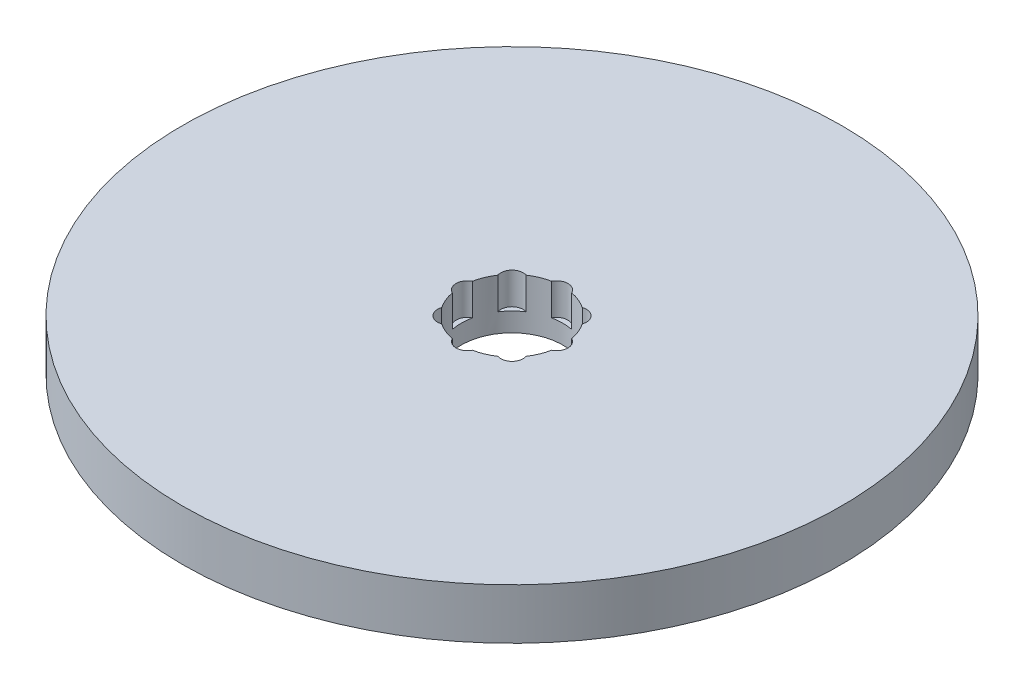
ISO-10303-21;
HEADER;
FILE_DESCRIPTION(('STEP AP214'),'2;1');
FILE_NAME('part.step','',(''),(''),'','','');
FILE_SCHEMA(('AUTOMOTIVE_DESIGN { 1 0 10303 214 1 1 1 1 }'));
ENDSEC;
DATA;
#1=APPLICATION_CONTEXT('core data for automotive mechanical design processes');
#2=APPLICATION_PROTOCOL_DEFINITION('international standard','automotive_design',2000,#1);
#3=PRODUCT_CONTEXT('',#1,'mechanical');
#4=PRODUCT('Part','Part','',(#3));
#5=PRODUCT_RELATED_PRODUCT_CATEGORY('part','',(#4));
#6=PRODUCT_DEFINITION_FORMATION('','',#4);
#7=PRODUCT_DEFINITION_CONTEXT('part definition',#1,'design');
#8=PRODUCT_DEFINITION('design','',#6,#7);
#9=PRODUCT_DEFINITION_SHAPE('','',#8);
#10=(LENGTH_UNIT() NAMED_UNIT(*) SI_UNIT(.MILLI.,.METRE.));
#11=(NAMED_UNIT(*) PLANE_ANGLE_UNIT() SI_UNIT($,.RADIAN.));
#12=(NAMED_UNIT(*) SI_UNIT($,.STERADIAN.) SOLID_ANGLE_UNIT());
#13=UNCERTAINTY_MEASURE_WITH_UNIT(LENGTH_MEASURE(1.E-05),#10,'distance_accuracy_value','');
#14=(GEOMETRIC_REPRESENTATION_CONTEXT(3) GLOBAL_UNCERTAINTY_ASSIGNED_CONTEXT((#13)) GLOBAL_UNIT_ASSIGNED_CONTEXT((#10,
#11,#12)) REPRESENTATION_CONTEXT('',''));
#15=CARTESIAN_POINT('',(0.,0.,0.));
#16=DIRECTION('',(0.,0.,1.));
#17=DIRECTION('',(1.,0.,0.));
#18=AXIS2_PLACEMENT_3D('',#15,#16,#17);
#19=CARTESIAN_POINT('',(0.,10.,0.));
#20=DIRECTION('',(0.,-1.,0.));
#21=DIRECTION('',(0.,0.,-1.));
#22=AXIS2_PLACEMENT_3D('',#19,#20,#21);
#23=CYLINDRICAL_SURFACE('',#22,65.);
#24=CARTESIAN_POINT('',(0.,10.,0.));
#25=DIRECTION('',(0.,1.,0.));
#26=DIRECTION('',(0.,0.,1.));
#27=AXIS2_PLACEMENT_3D('',#24,#25,#26);
#28=CIRCLE('',#27,65.);
#29=CARTESIAN_POINT('',(0.,10.,65.));
#30=VERTEX_POINT('',#29);
#31=EDGE_CURVE('E183',#30,#30,#28,.T.);
#32=ORIENTED_EDGE('',*,*,#31,.F.);
#33=EDGE_LOOP('',(#32));
#34=FACE_BOUND('',#33,.T.);
#35=CARTESIAN_POINT('',(0.,0.,0.));
#36=DIRECTION('',(0.,1.,0.));
#37=DIRECTION('',(0.,0.,1.));
#38=AXIS2_PLACEMENT_3D('',#35,#36,#37);
#39=CIRCLE('',#38,65.);
#40=CARTESIAN_POINT('',(0.,0.,65.));
#41=VERTEX_POINT('',#40);
#42=EDGE_CURVE('E182',#41,#41,#39,.T.);
#43=ORIENTED_EDGE('',*,*,#42,.T.);
#44=EDGE_LOOP('',(#43));
#45=FACE_BOUND('',#44,.T.);
#46=ADVANCED_FACE('F39',(#34,#45),#23,.T.);
#47=CARTESIAN_POINT('',(0.,10.,0.));
#48=DIRECTION('',(0.,1.,0.));
#49=DIRECTION('',(0.,0.,1.));
#50=AXIS2_PLACEMENT_3D('',#47,#48,#49);
#51=PLANE('',#50);
#52=CARTESIAN_POINT('',(0.,10.,8.81832468937338));
#53=DIRECTION('',(0.,1.,0.));
#54=DIRECTION('',(1.,0.,0.));
#55=AXIS2_PLACEMENT_3D('',#52,#53,#54);
#56=CIRCLE('',#55,2.20818495397574);
#57=CARTESIAN_POINT('',(-1.97663540559825,10.,9.80269924425591));
#58=VERTEX_POINT('',#57);
#59=CARTESIAN_POINT('',(1.97663540559832,10.,9.8026992442559));
#60=VERTEX_POINT('',#59);
#61=EDGE_CURVE('E256',#58,#60,#56,.T.);
#62=ORIENTED_EDGE('',*,*,#61,.F.);
#63=CARTESIAN_POINT('',(0.,10.,0.));
#64=DIRECTION('',(0.,1.,0.));
#65=DIRECTION('',(0.,0.,1.));
#66=AXIS2_PLACEMENT_3D('',#63,#64,#65);
#67=CIRCLE('',#66,10.);
#68=CARTESIAN_POINT('',(-5.53386281031361,10.,8.32924740877757));
#69=VERTEX_POINT('',#68);
#70=EDGE_CURVE('E175',#69,#58,#67,.T.);
#71=ORIENTED_EDGE('',*,*,#70,.F.);
#72=CARTESIAN_POINT('',(-6.23549718656067,10.,6.23549718656069));
#73=DIRECTION('',(0.,1.,0.));
#74=DIRECTION('',(0.707106781186549,0.,0.707106781186546));
#75=AXIS2_PLACEMENT_3D('',#72,#73,#74);
#76=CIRCLE('',#75,2.20818495397574);
#77=CARTESIAN_POINT('',(-8.32924740877755,10.,5.53386281031364));
#78=VERTEX_POINT('',#77);
#79=EDGE_CURVE('E152',#78,#69,#76,.T.);
#80=ORIENTED_EDGE('',*,*,#79,.F.);
#81=CARTESIAN_POINT('',(-9.8026992442559,10.,1.97663540559828));
#82=VERTEX_POINT('',#81);
#83=EDGE_CURVE('E168',#82,#78,#67,.T.);
#84=ORIENTED_EDGE('',*,*,#83,.F.);
#85=CARTESIAN_POINT('',(-8.81832468937338,10.,0.));
#86=DIRECTION('',(0.,1.,0.));
#87=DIRECTION('',(0.,0.,1.));
#88=AXIS2_PLACEMENT_3D('',#85,#86,#87);
#89=CIRCLE('',#88,2.20818495397574);
#90=CARTESIAN_POINT('',(-9.8026992442559,10.,-1.97663540559828));
#91=VERTEX_POINT('',#90);
#92=EDGE_CURVE('E205',#91,#82,#89,.T.);
#93=ORIENTED_EDGE('',*,*,#92,.F.);
#94=CARTESIAN_POINT('',(-8.32924740877763,10.,-5.53386281031353));
#95=VERTEX_POINT('',#94);
#96=EDGE_CURVE('E181',#95,#91,#67,.T.);
#97=ORIENTED_EDGE('',*,*,#96,.F.);
#98=CARTESIAN_POINT('',(-6.23549718656075,10.,-6.2354971865606));
#99=DIRECTION('',(0.,1.,0.));
#100=DIRECTION('',(-0.707106781186539,0.,0.707106781186556));
#101=AXIS2_PLACEMENT_3D('',#98,#99,#100);
#102=CIRCLE('',#101,2.20818495397574);
#103=CARTESIAN_POINT('',(-5.53386281031373,10.,-8.3292474087775));
#104=VERTEX_POINT('',#103);
#105=EDGE_CURVE('E453',#104,#95,#102,.T.);
#106=ORIENTED_EDGE('',*,*,#105,.F.);
#107=CARTESIAN_POINT('',(-1.97663540559839,10.,-9.80269924425588));
#108=VERTEX_POINT('',#107);
#109=EDGE_CURVE('E189',#108,#104,#67,.T.);
#110=ORIENTED_EDGE('',*,*,#109,.F.);
#111=CARTESIAN_POINT('',(0.,10.,-8.81832468937338));
#112=DIRECTION('',(0.,1.,0.));
#113=DIRECTION('',(-1.,0.,0.));
#114=AXIS2_PLACEMENT_3D('',#111,#112,#113);
#115=CIRCLE('',#114,2.20818495397574);
#116=CARTESIAN_POINT('',(1.97663540559818,10.,-9.80269924425593));
#117=VERTEX_POINT('',#116);
#118=EDGE_CURVE('E462',#117,#108,#115,.T.);
#119=ORIENTED_EDGE('',*,*,#118,.F.);
#120=CARTESIAN_POINT('',(5.53386281031356,10.,-8.32924740877761));
#121=VERTEX_POINT('',#120);
#122=EDGE_CURVE('E197',#121,#117,#67,.T.);
#123=ORIENTED_EDGE('',*,*,#122,.F.);
#124=CARTESIAN_POINT('',(6.23549718656062,10.,-6.23549718656073));
#125=DIRECTION('',(0.,1.,0.));
#126=DIRECTION('',(-0.707106781186554,0.,-0.707106781186541));
#127=AXIS2_PLACEMENT_3D('',#124,#125,#126);
#128=CIRCLE('',#127,2.20818495397574);
#129=CARTESIAN_POINT('',(8.32924740877752,10.,-5.5338628103137));
#130=VERTEX_POINT('',#129);
#131=EDGE_CURVE('E470',#130,#121,#128,.T.);
#132=ORIENTED_EDGE('',*,*,#131,.F.);
#133=CARTESIAN_POINT('',(9.8026992442559,10.,-1.97663540559828));
#134=VERTEX_POINT('',#133);
#135=EDGE_CURVE('E489',#134,#130,#67,.T.);
#136=ORIENTED_EDGE('',*,*,#135,.F.);
#137=CARTESIAN_POINT('',(8.81832468937338,10.,0.));
#138=DIRECTION('',(0.,1.,0.));
#139=DIRECTION('',(0.,0.,-1.));
#140=AXIS2_PLACEMENT_3D('',#137,#138,#139);
#141=CIRCLE('',#140,2.20818495397574);
#142=CARTESIAN_POINT('',(9.8026992442559,10.,1.97663540559828));
#143=VERTEX_POINT('',#142);
#144=EDGE_CURVE('E476',#143,#134,#141,.T.);
#145=ORIENTED_EDGE('',*,*,#144,.F.);
#146=CARTESIAN_POINT('',(8.32924740877759,10.,5.53386281031358));
#147=VERTEX_POINT('',#146);
#148=EDGE_CURVE('E491',#147,#143,#67,.T.);
#149=ORIENTED_EDGE('',*,*,#148,.F.);
#150=CARTESIAN_POINT('',(6.23549718656071,10.,6.23549718656064));
#151=DIRECTION('',(0.,1.,0.));
#152=DIRECTION('',(0.707106781186544,0.,-0.707106781186551));
#153=AXIS2_PLACEMENT_3D('',#150,#151,#152);
#154=CIRCLE('',#153,2.20818495397574);
#155=CARTESIAN_POINT('',(5.53386281031367,10.,8.32924740877754));
#156=VERTEX_POINT('',#155);
#157=EDGE_CURVE('E475',#156,#147,#154,.T.);
#158=ORIENTED_EDGE('',*,*,#157,.F.);
#159=EDGE_CURVE('E190',#60,#156,#67,.T.);
#160=ORIENTED_EDGE('',*,*,#159,.F.);
#161=EDGE_LOOP('',(#62,#71,#80,#84,#93,#97,#106,#110,#119,#123,#132,#136,#145,#149,#158,#160));
#162=FACE_BOUND('',#161,.T.);
#163=ORIENTED_EDGE('',*,*,#31,.T.);
#164=EDGE_LOOP('',(#163));
#165=FACE_BOUND('',#164,.T.);
#166=ADVANCED_FACE('F170',(#162,#165),#51,.T.);
#167=CARTESIAN_POINT('',(0.,0.,0.));
#168=DIRECTION('',(0.,1.,0.));
#169=DIRECTION('',(0.,0.,1.));
#170=AXIS2_PLACEMENT_3D('',#167,#168,#169);
#171=PLANE('',#170);
#172=CARTESIAN_POINT('',(0.,0.,0.));
#173=DIRECTION('',(0.,1.,0.));
#174=DIRECTION('',(0.,0.,1.));
#175=AXIS2_PLACEMENT_3D('',#172,#173,#174);
#176=CIRCLE('',#175,10.);
#177=CARTESIAN_POINT('',(0.,0.,10.));
#178=VERTEX_POINT('',#177);
#179=EDGE_CURVE('E191',#178,#178,#176,.T.);
#180=ORIENTED_EDGE('',*,*,#179,.T.);
#181=EDGE_LOOP('',(#180));
#182=FACE_BOUND('',#181,.T.);
#183=ORIENTED_EDGE('',*,*,#42,.F.);
#184=EDGE_LOOP('',(#183));
#185=FACE_BOUND('',#184,.T.);
#186=ADVANCED_FACE('F277',(#182,#185),#171,.F.);
#187=CARTESIAN_POINT('',(0.,10.,0.));
#188=DIRECTION('',(0.,-1.,0.));
#189=DIRECTION('',(0.,0.,-1.));
#190=AXIS2_PLACEMENT_3D('',#187,#188,#189);
#191=CYLINDRICAL_SURFACE('',#190,10.);
#192=DIRECTION('',(0.,1.,0.));
#193=VECTOR('',#192,1.);
#194=CARTESIAN_POINT('',(-1.97663540559825,6.87015416845425,9.80269924425591));
#195=LINE('',#194,#193);
#196=CARTESIAN_POINT('',(-1.97663540559825,3.7403083369085,9.80269924425591));
#197=VERTEX_POINT('',#196);
#198=EDGE_CURVE('E11',#197,#58,#195,.T.);
#199=ORIENTED_EDGE('',*,*,#198,.F.);
#200=CARTESIAN_POINT('',(0.,3.7403083369085,0.));
#201=DIRECTION('',(0.,1.,0.));
#202=DIRECTION('',(0.,0.,1.));
#203=AXIS2_PLACEMENT_3D('',#200,#201,#202);
#204=CIRCLE('',#203,10.);
#205=CARTESIAN_POINT('',(1.97663540559832,3.7403083369085,9.8026992442559));
#206=VERTEX_POINT('',#205);
#207=EDGE_CURVE('E251',#197,#206,#204,.T.);
#208=ORIENTED_EDGE('',*,*,#207,.T.);
#209=DIRECTION('',(0.,1.,0.));
#210=VECTOR('',#209,1.);
#211=CARTESIAN_POINT('',(1.97663540559832,6.87015416845425,9.8026992442559));
#212=LINE('',#211,#210);
#213=EDGE_CURVE('E46',#60,#206,#212,.F.);
#214=ORIENTED_EDGE('',*,*,#213,.F.);
#215=ORIENTED_EDGE('',*,*,#159,.T.);
#216=DIRECTION('',(0.,1.,0.));
#217=VECTOR('',#216,1.);
#218=CARTESIAN_POINT('',(5.53386281031367,6.87015416845425,8.32924740877753));
#219=LINE('',#218,#217);
#220=CARTESIAN_POINT('',(5.53386281031367,3.7403083369085,8.32924740877754));
#221=VERTEX_POINT('',#220);
#222=EDGE_CURVE('E253',#221,#156,#219,.T.);
#223=ORIENTED_EDGE('',*,*,#222,.F.);
#224=CARTESIAN_POINT('',(0.,3.7403083369085,0.));
#225=DIRECTION('',(0.,1.,0.));
#226=DIRECTION('',(0.,0.,1.));
#227=AXIS2_PLACEMENT_3D('',#224,#225,#226);
#228=CIRCLE('',#227,10.);
#229=CARTESIAN_POINT('',(8.32924740877759,3.7403083369085,5.53386281031358));
#230=VERTEX_POINT('',#229);
#231=EDGE_CURVE('E246',#221,#230,#228,.T.);
#232=ORIENTED_EDGE('',*,*,#231,.T.);
#233=DIRECTION('',(0.,1.,0.));
#234=VECTOR('',#233,1.);
#235=CARTESIAN_POINT('',(8.32924740877759,6.87015416845425,5.53386281031358));
#236=LINE('',#235,#234);
#237=EDGE_CURVE('E248',#147,#230,#236,.F.);
#238=ORIENTED_EDGE('',*,*,#237,.F.);
#239=ORIENTED_EDGE('',*,*,#148,.T.);
#240=DIRECTION('',(0.,1.,0.));
#241=VECTOR('',#240,1.);
#242=CARTESIAN_POINT('',(9.8026992442559,6.87015416845425,1.97663540559829));
#243=LINE('',#242,#241);
#244=CARTESIAN_POINT('',(9.8026992442559,3.7403083369085,1.97663540559828));
#245=VERTEX_POINT('',#244);
#246=EDGE_CURVE('E243',#245,#143,#243,.T.);
#247=ORIENTED_EDGE('',*,*,#246,.F.);
#248=CARTESIAN_POINT('',(0.,3.7403083369085,0.));
#249=DIRECTION('',(0.,1.,0.));
#250=DIRECTION('',(0.,0.,1.));
#251=AXIS2_PLACEMENT_3D('',#248,#249,#250);
#252=CIRCLE('',#251,10.);
#253=CARTESIAN_POINT('',(9.8026992442559,3.7403083369085,-1.97663540559828));
#254=VERTEX_POINT('',#253);
#255=EDGE_CURVE('E236',#245,#254,#252,.T.);
#256=ORIENTED_EDGE('',*,*,#255,.T.);
#257=DIRECTION('',(0.,1.,0.));
#258=VECTOR('',#257,1.);
#259=CARTESIAN_POINT('',(9.8026992442559,6.87015416845425,-1.97663540559829));
#260=LINE('',#259,#258);
#261=EDGE_CURVE('E241',#134,#254,#260,.F.);
#262=ORIENTED_EDGE('',*,*,#261,.F.);
#263=ORIENTED_EDGE('',*,*,#135,.T.);
#264=DIRECTION('',(0.,1.,0.));
#265=VECTOR('',#264,1.);
#266=CARTESIAN_POINT('',(8.32924740877752,6.87015416845425,-5.5338628103137));
#267=LINE('',#266,#265);
#268=CARTESIAN_POINT('',(8.32924740877752,3.7403083369085,-5.5338628103137));
#269=VERTEX_POINT('',#268);
#270=EDGE_CURVE('E237',#269,#130,#267,.T.);
#271=ORIENTED_EDGE('',*,*,#270,.F.);
#272=CARTESIAN_POINT('',(0.,3.7403083369085,0.));
#273=DIRECTION('',(0.,1.,0.));
#274=DIRECTION('',(0.,0.,1.));
#275=AXIS2_PLACEMENT_3D('',#272,#273,#274);
#276=CIRCLE('',#275,10.);
#277=CARTESIAN_POINT('',(5.53386281031356,3.7403083369085,-8.32924740877761));
#278=VERTEX_POINT('',#277);
#279=EDGE_CURVE('E229',#269,#278,#276,.T.);
#280=ORIENTED_EDGE('',*,*,#279,.T.);
#281=DIRECTION('',(0.,1.,0.));
#282=VECTOR('',#281,1.);
#283=CARTESIAN_POINT('',(5.53386281031355,6.87015416845425,-8.32924740877761));
#284=LINE('',#283,#282);
#285=EDGE_CURVE('E232',#121,#278,#284,.F.);
#286=ORIENTED_EDGE('',*,*,#285,.F.);
#287=ORIENTED_EDGE('',*,*,#122,.T.);
#288=DIRECTION('',(0.,1.,0.));
#289=VECTOR('',#288,1.);
#290=CARTESIAN_POINT('',(1.97663540559818,6.87015416845425,-9.80269924425592));
#291=LINE('',#290,#289);
#292=CARTESIAN_POINT('',(1.97663540559818,3.7403083369085,-9.80269924425593));
#293=VERTEX_POINT('',#292);
#294=EDGE_CURVE('E227',#293,#117,#291,.T.);
#295=ORIENTED_EDGE('',*,*,#294,.F.);
#296=CARTESIAN_POINT('',(0.,3.7403083369085,0.));
#297=DIRECTION('',(0.,1.,0.));
#298=DIRECTION('',(0.,0.,1.));
#299=AXIS2_PLACEMENT_3D('',#296,#297,#298);
#300=CIRCLE('',#299,10.);
#301=CARTESIAN_POINT('',(-1.97663540559839,3.7403083369085,-9.80269924425588));
#302=VERTEX_POINT('',#301);
#303=EDGE_CURVE('E225',#293,#302,#300,.T.);
#304=ORIENTED_EDGE('',*,*,#303,.T.);
#305=DIRECTION('',(0.,1.,0.));
#306=VECTOR('',#305,1.);
#307=CARTESIAN_POINT('',(-1.97663540559839,6.87015416845425,-9.80269924425588));
#308=LINE('',#307,#306);
#309=EDGE_CURVE('E223',#108,#302,#308,.F.);
#310=ORIENTED_EDGE('',*,*,#309,.F.);
#311=ORIENTED_EDGE('',*,*,#109,.T.);
#312=DIRECTION('',(0.,1.,0.));
#313=VECTOR('',#312,1.);
#314=CARTESIAN_POINT('',(-5.53386281031373,6.87015416845425,-8.3292474087775));
#315=LINE('',#314,#313);
#316=CARTESIAN_POINT('',(-5.53386281031373,3.7403083369085,-8.3292474087775));
#317=VERTEX_POINT('',#316);
#318=EDGE_CURVE('E219',#317,#104,#315,.T.);
#319=ORIENTED_EDGE('',*,*,#318,.F.);
#320=CARTESIAN_POINT('',(0.,3.7403083369085,0.));
#321=DIRECTION('',(0.,1.,0.));
#322=DIRECTION('',(0.,0.,1.));
#323=AXIS2_PLACEMENT_3D('',#320,#321,#322);
#324=CIRCLE('',#323,10.);
#325=CARTESIAN_POINT('',(-8.32924740877763,3.7403083369085,-5.53386281031353));
#326=VERTEX_POINT('',#325);
#327=EDGE_CURVE('E159',#317,#326,#324,.T.);
#328=ORIENTED_EDGE('',*,*,#327,.T.);
#329=DIRECTION('',(0.,1.,0.));
#330=VECTOR('',#329,1.);
#331=CARTESIAN_POINT('',(-8.32924740877763,6.87015416845425,-5.53386281031352));
#332=LINE('',#331,#330);
#333=EDGE_CURVE('E220',#95,#326,#332,.F.);
#334=ORIENTED_EDGE('',*,*,#333,.F.);
#335=ORIENTED_EDGE('',*,*,#96,.T.);
#336=DIRECTION('',(0.,1.,0.));
#337=VECTOR('',#336,1.);
#338=CARTESIAN_POINT('',(-9.8026992442559,6.87015416845425,-1.97663540559829));
#339=LINE('',#338,#337);
#340=CARTESIAN_POINT('',(-9.8026992442559,3.7403083369085,-1.97663540559828));
#341=VERTEX_POINT('',#340);
#342=EDGE_CURVE('E209',#341,#91,#339,.T.);
#343=ORIENTED_EDGE('',*,*,#342,.F.);
#344=CARTESIAN_POINT('',(0.,3.7403083369085,0.));
#345=DIRECTION('',(0.,1.,0.));
#346=DIRECTION('',(0.,0.,1.));
#347=AXIS2_PLACEMENT_3D('',#344,#345,#346);
#348=CIRCLE('',#347,10.);
#349=CARTESIAN_POINT('',(-9.8026992442559,3.7403083369085,1.97663540559828));
#350=VERTEX_POINT('',#349);
#351=EDGE_CURVE('E206',#341,#350,#348,.T.);
#352=ORIENTED_EDGE('',*,*,#351,.T.);
#353=DIRECTION('',(0.,1.,0.));
#354=VECTOR('',#353,1.);
#355=CARTESIAN_POINT('',(-9.8026992442559,6.87015416845425,1.97663540559829));
#356=LINE('',#355,#354);
#357=EDGE_CURVE('E179',#82,#350,#356,.F.);
#358=ORIENTED_EDGE('',*,*,#357,.F.);
#359=ORIENTED_EDGE('',*,*,#83,.T.);
#360=DIRECTION('',(0.,1.,0.));
#361=VECTOR('',#360,1.);
#362=CARTESIAN_POINT('',(-8.32924740877755,6.87015416845425,5.53386281031364));
#363=LINE('',#362,#361);
#364=CARTESIAN_POINT('',(-8.32924740877755,3.7403083369085,5.53386281031364));
#365=VERTEX_POINT('',#364);
#366=EDGE_CURVE('E147',#365,#78,#363,.T.);
#367=ORIENTED_EDGE('',*,*,#366,.F.);
#368=CARTESIAN_POINT('',(0.,3.7403083369085,0.));
#369=DIRECTION('',(0.,1.,0.));
#370=DIRECTION('',(0.,0.,1.));
#371=AXIS2_PLACEMENT_3D('',#368,#369,#370);
#372=CIRCLE('',#371,10.);
#373=CARTESIAN_POINT('',(-5.53386281031361,3.7403083369085,8.32924740877757));
#374=VERTEX_POINT('',#373);
#375=EDGE_CURVE('E215',#365,#374,#372,.T.);
#376=ORIENTED_EDGE('',*,*,#375,.T.);
#377=DIRECTION('',(0.,1.,0.));
#378=VECTOR('',#377,1.);
#379=CARTESIAN_POINT('',(-5.53386281031361,6.87015416845425,8.32924740877757));
#380=LINE('',#379,#378);
#381=EDGE_CURVE('E161',#69,#374,#380,.F.);
#382=ORIENTED_EDGE('',*,*,#381,.F.);
#383=ORIENTED_EDGE('',*,*,#70,.T.);
#384=EDGE_LOOP('',(#199,#208,#214,#215,#223,#232,#238,#239,#247,#256,#262,#263,#271,#280,#286,
#287,#295,#304,#310,#311,#319,#328,#334,#335,#343,#352,#358,#359,#367,#376,#382,#383));
#385=FACE_BOUND('',#384,.T.);
#386=ORIENTED_EDGE('',*,*,#179,.F.);
#387=EDGE_LOOP('',(#386));
#388=FACE_BOUND('',#387,.T.);
#389=ADVANCED_FACE('F176',(#385,#388),#191,.F.);
#390=CARTESIAN_POINT('',(-8.81832468937338,3.7403083369085,0.));
#391=DIRECTION('',(0.,1.,0.));
#392=DIRECTION('',(0.,0.,1.));
#393=AXIS2_PLACEMENT_3D('',#390,#391,#392);
#394=CYLINDRICAL_SURFACE('',#393,2.20818495397574);
#395=ORIENTED_EDGE('',*,*,#342,.T.);
#396=ORIENTED_EDGE('',*,*,#92,.T.);
#397=ORIENTED_EDGE('',*,*,#357,.T.);
#398=CARTESIAN_POINT('',(-8.81832468937338,3.7403083369085,0.));
#399=DIRECTION('',(0.,1.,0.));
#400=DIRECTION('',(0.,0.,1.));
#401=AXIS2_PLACEMENT_3D('',#398,#399,#400);
#402=CIRCLE('',#401,2.20818495397574);
#403=EDGE_CURVE('E200',#341,#350,#402,.T.);
#404=ORIENTED_EDGE('',*,*,#403,.F.);
#405=EDGE_LOOP('',(#395,#396,#397,#404));
#406=FACE_BOUND('',#405,.T.);
#407=ADVANCED_FACE('F286',(#406),#394,.F.);
#408=CARTESIAN_POINT('',(-8.81832468937338,3.7403083369085,0.));
#409=DIRECTION('',(0.,1.,0.));
#410=DIRECTION('',(0.,0.,1.));
#411=AXIS2_PLACEMENT_3D('',#408,#409,#410);
#412=PLANE('',#411);
#413=ORIENTED_EDGE('',*,*,#403,.T.);
#414=ORIENTED_EDGE('',*,*,#351,.F.);
#415=EDGE_LOOP('',(#413,#414));
#416=FACE_BOUND('',#415,.T.);
#417=ADVANCED_FACE('F289',(#416),#412,.T.);
#418=CARTESIAN_POINT('',(-6.23549718656067,3.7403083369085,6.23549718656069));
#419=DIRECTION('',(0.,1.,0.));
#420=DIRECTION('',(0.,0.,1.));
#421=AXIS2_PLACEMENT_3D('',#418,#419,#420);
#422=CYLINDRICAL_SURFACE('',#421,2.20818495397574);
#423=ORIENTED_EDGE('',*,*,#366,.T.);
#424=ORIENTED_EDGE('',*,*,#79,.T.);
#425=ORIENTED_EDGE('',*,*,#381,.T.);
#426=CARTESIAN_POINT('',(-6.23549718656067,3.7403083369085,6.23549718656069));
#427=DIRECTION('',(0.,1.,0.));
#428=DIRECTION('',(0.707106781186549,0.,0.707106781186546));
#429=AXIS2_PLACEMENT_3D('',#426,#427,#428);
#430=CIRCLE('',#429,2.20818495397574);
#431=EDGE_CURVE('E156',#365,#374,#430,.T.);
#432=ORIENTED_EDGE('',*,*,#431,.F.);
#433=EDGE_LOOP('',(#423,#424,#425,#432));
#434=FACE_BOUND('',#433,.T.);
#435=ADVANCED_FACE('F155',(#434),#422,.F.);
#436=CARTESIAN_POINT('',(-6.23549718656067,3.7403083369085,6.23549718656069));
#437=DIRECTION('',(0.,1.,0.));
#438=DIRECTION('',(0.707106781186549,0.,0.707106781186546));
#439=AXIS2_PLACEMENT_3D('',#436,#437,#438);
#440=PLANE('',#439);
#441=ORIENTED_EDGE('',*,*,#431,.T.);
#442=ORIENTED_EDGE('',*,*,#375,.F.);
#443=EDGE_LOOP('',(#441,#442));
#444=FACE_BOUND('',#443,.T.);
#445=ADVANCED_FACE('F300',(#444),#440,.T.);
#446=CARTESIAN_POINT('',(-6.23549718656075,3.7403083369085,-6.2354971865606));
#447=DIRECTION('',(0.,1.,0.));
#448=DIRECTION('',(0.,0.,1.));
#449=AXIS2_PLACEMENT_3D('',#446,#447,#448);
#450=CYLINDRICAL_SURFACE('',#449,2.20818495397574);
#451=ORIENTED_EDGE('',*,*,#318,.T.);
#452=ORIENTED_EDGE('',*,*,#105,.T.);
#453=ORIENTED_EDGE('',*,*,#333,.T.);
#454=CARTESIAN_POINT('',(-6.23549718656075,3.7403083369085,-6.2354971865606));
#455=DIRECTION('',(0.,1.,0.));
#456=DIRECTION('',(-0.707106781186539,0.,0.707106781186556));
#457=AXIS2_PLACEMENT_3D('',#454,#455,#456);
#458=CIRCLE('',#457,2.20818495397574);
#459=EDGE_CURVE('E454',#317,#326,#458,.T.);
#460=ORIENTED_EDGE('',*,*,#459,.F.);
#461=EDGE_LOOP('',(#451,#452,#453,#460));
#462=FACE_BOUND('',#461,.T.);
#463=ADVANCED_FACE('F299',(#462),#450,.F.);
#464=CARTESIAN_POINT('',(-6.23549718656075,3.7403083369085,-6.2354971865606));
#465=DIRECTION('',(0.,1.,0.));
#466=DIRECTION('',(-0.707106781186539,0.,0.707106781186556));
#467=AXIS2_PLACEMENT_3D('',#464,#465,#466);
#468=PLANE('',#467);
#469=ORIENTED_EDGE('',*,*,#459,.T.);
#470=ORIENTED_EDGE('',*,*,#327,.F.);
#471=EDGE_LOOP('',(#469,#470));
#472=FACE_BOUND('',#471,.T.);
#473=ADVANCED_FACE('F379',(#472),#468,.T.);
#474=CARTESIAN_POINT('',(0.,3.7403083369085,-8.81832468937338));
#475=DIRECTION('',(0.,1.,0.));
#476=DIRECTION('',(0.,0.,1.));
#477=AXIS2_PLACEMENT_3D('',#474,#475,#476);
#478=CYLINDRICAL_SURFACE('',#477,2.20818495397574);
#479=ORIENTED_EDGE('',*,*,#294,.T.);
#480=ORIENTED_EDGE('',*,*,#118,.T.);
#481=ORIENTED_EDGE('',*,*,#309,.T.);
#482=CARTESIAN_POINT('',(0.,3.7403083369085,-8.81832468937338));
#483=DIRECTION('',(0.,1.,0.));
#484=DIRECTION('',(-1.,0.,0.));
#485=AXIS2_PLACEMENT_3D('',#482,#483,#484);
#486=CIRCLE('',#485,2.20818495397574);
#487=EDGE_CURVE('E465',#293,#302,#486,.T.);
#488=ORIENTED_EDGE('',*,*,#487,.F.);
#489=EDGE_LOOP('',(#479,#480,#481,#488));
#490=FACE_BOUND('',#489,.T.);
#491=ADVANCED_FACE('F371',(#490),#478,.F.);
#492=CARTESIAN_POINT('',(0.,3.7403083369085,-8.81832468937338));
#493=DIRECTION('',(0.,1.,0.));
#494=DIRECTION('',(-1.,0.,0.));
#495=AXIS2_PLACEMENT_3D('',#492,#493,#494);
#496=PLANE('',#495);
#497=ORIENTED_EDGE('',*,*,#487,.T.);
#498=ORIENTED_EDGE('',*,*,#303,.F.);
#499=EDGE_LOOP('',(#497,#498));
#500=FACE_BOUND('',#499,.T.);
#501=ADVANCED_FACE('F308',(#500),#496,.T.);
#502=CARTESIAN_POINT('',(6.23549718656062,3.7403083369085,-6.23549718656073));
#503=DIRECTION('',(0.,1.,0.));
#504=DIRECTION('',(0.,0.,1.));
#505=AXIS2_PLACEMENT_3D('',#502,#503,#504);
#506=CYLINDRICAL_SURFACE('',#505,2.20818495397574);
#507=ORIENTED_EDGE('',*,*,#270,.T.);
#508=ORIENTED_EDGE('',*,*,#131,.T.);
#509=ORIENTED_EDGE('',*,*,#285,.T.);
#510=CARTESIAN_POINT('',(6.23549718656062,3.7403083369085,-6.23549718656073));
#511=DIRECTION('',(0.,1.,0.));
#512=DIRECTION('',(-0.707106781186554,0.,-0.707106781186541));
#513=AXIS2_PLACEMENT_3D('',#510,#511,#512);
#514=CIRCLE('',#513,2.20818495397574);
#515=EDGE_CURVE('E477',#269,#278,#514,.T.);
#516=ORIENTED_EDGE('',*,*,#515,.F.);
#517=EDGE_LOOP('',(#507,#508,#509,#516));
#518=FACE_BOUND('',#517,.T.);
#519=ADVANCED_FACE('F305',(#518),#506,.F.);
#520=CARTESIAN_POINT('',(6.23549718656062,3.7403083369085,-6.23549718656073));
#521=DIRECTION('',(0.,1.,0.));
#522=DIRECTION('',(-0.707106781186554,0.,-0.707106781186541));
#523=AXIS2_PLACEMENT_3D('',#520,#521,#522);
#524=PLANE('',#523);
#525=ORIENTED_EDGE('',*,*,#515,.T.);
#526=ORIENTED_EDGE('',*,*,#279,.F.);
#527=EDGE_LOOP('',(#525,#526));
#528=FACE_BOUND('',#527,.T.);
#529=ADVANCED_FACE('F304',(#528),#524,.T.);
#530=CARTESIAN_POINT('',(8.81832468937338,3.7403083369085,0.));
#531=DIRECTION('',(0.,1.,0.));
#532=DIRECTION('',(0.,0.,1.));
#533=AXIS2_PLACEMENT_3D('',#530,#531,#532);
#534=CYLINDRICAL_SURFACE('',#533,2.20818495397574);
#535=ORIENTED_EDGE('',*,*,#246,.T.);
#536=ORIENTED_EDGE('',*,*,#144,.T.);
#537=ORIENTED_EDGE('',*,*,#261,.T.);
#538=CARTESIAN_POINT('',(8.81832468937338,3.7403083369085,0.));
#539=DIRECTION('',(0.,1.,0.));
#540=DIRECTION('',(0.,0.,-1.));
#541=AXIS2_PLACEMENT_3D('',#538,#539,#540);
#542=CIRCLE('',#541,2.20818495397574);
#543=EDGE_CURVE('E478',#245,#254,#542,.T.);
#544=ORIENTED_EDGE('',*,*,#543,.F.);
#545=EDGE_LOOP('',(#535,#536,#537,#544));
#546=FACE_BOUND('',#545,.T.);
#547=ADVANCED_FACE('F309',(#546),#534,.F.);
#548=CARTESIAN_POINT('',(8.81832468937338,3.7403083369085,0.));
#549=DIRECTION('',(0.,1.,0.));
#550=DIRECTION('',(0.,0.,-1.));
#551=AXIS2_PLACEMENT_3D('',#548,#549,#550);
#552=PLANE('',#551);
#553=ORIENTED_EDGE('',*,*,#543,.T.);
#554=ORIENTED_EDGE('',*,*,#255,.F.);
#555=EDGE_LOOP('',(#553,#554));
#556=FACE_BOUND('',#555,.T.);
#557=ADVANCED_FACE('F314',(#556),#552,.T.);
#558=CARTESIAN_POINT('',(6.23549718656071,3.7403083369085,6.23549718656064));
#559=DIRECTION('',(0.,1.,0.));
#560=DIRECTION('',(0.,0.,1.));
#561=AXIS2_PLACEMENT_3D('',#558,#559,#560);
#562=CYLINDRICAL_SURFACE('',#561,2.20818495397574);
#563=ORIENTED_EDGE('',*,*,#222,.T.);
#564=ORIENTED_EDGE('',*,*,#157,.T.);
#565=ORIENTED_EDGE('',*,*,#237,.T.);
#566=CARTESIAN_POINT('',(6.23549718656071,3.7403083369085,6.23549718656064));
#567=DIRECTION('',(0.,1.,0.));
#568=DIRECTION('',(0.707106781186544,0.,-0.707106781186551));
#569=AXIS2_PLACEMENT_3D('',#566,#567,#568);
#570=CIRCLE('',#569,2.20818495397574);
#571=EDGE_CURVE('E56',#221,#230,#570,.T.);
#572=ORIENTED_EDGE('',*,*,#571,.F.);
#573=EDGE_LOOP('',(#563,#564,#565,#572));
#574=FACE_BOUND('',#573,.T.);
#575=ADVANCED_FACE('F318',(#574),#562,.F.);
#576=CARTESIAN_POINT('',(6.23549718656071,3.7403083369085,6.23549718656064));
#577=DIRECTION('',(0.,1.,0.));
#578=DIRECTION('',(0.707106781186544,0.,-0.707106781186551));
#579=AXIS2_PLACEMENT_3D('',#576,#577,#578);
#580=PLANE('',#579);
#581=ORIENTED_EDGE('',*,*,#571,.T.);
#582=ORIENTED_EDGE('',*,*,#231,.F.);
#583=EDGE_LOOP('',(#581,#582));
#584=FACE_BOUND('',#583,.T.);
#585=ADVANCED_FACE('F270',(#584),#580,.T.);
#586=CARTESIAN_POINT('',(0.,3.7403083369085,8.81832468937338));
#587=DIRECTION('',(0.,1.,0.));
#588=DIRECTION('',(0.,0.,1.));
#589=AXIS2_PLACEMENT_3D('',#586,#587,#588);
#590=CYLINDRICAL_SURFACE('',#589,2.20818495397574);
#591=ORIENTED_EDGE('',*,*,#198,.T.);
#592=ORIENTED_EDGE('',*,*,#61,.T.);
#593=ORIENTED_EDGE('',*,*,#213,.T.);
#594=CARTESIAN_POINT('',(0.,3.7403083369085,8.81832468937338));
#595=DIRECTION('',(0.,1.,0.));
#596=DIRECTION('',(1.,0.,0.));
#597=AXIS2_PLACEMENT_3D('',#594,#595,#596);
#598=CIRCLE('',#597,2.20818495397574);
#599=EDGE_CURVE('E55',#197,#206,#598,.T.);
#600=ORIENTED_EDGE('',*,*,#599,.F.);
#601=EDGE_LOOP('',(#591,#592,#593,#600));
#602=FACE_BOUND('',#601,.T.);
#603=ADVANCED_FACE('F260',(#602),#590,.F.);
#604=CARTESIAN_POINT('',(0.,3.7403083369085,8.81832468937338));
#605=DIRECTION('',(0.,1.,0.));
#606=DIRECTION('',(1.,0.,0.));
#607=AXIS2_PLACEMENT_3D('',#604,#605,#606);
#608=PLANE('',#607);
#609=ORIENTED_EDGE('',*,*,#599,.T.);
#610=ORIENTED_EDGE('',*,*,#207,.F.);
#611=EDGE_LOOP('',(#609,#610));
#612=FACE_BOUND('',#611,.T.);
#613=ADVANCED_FACE('F261',(#612),#608,.T.);
#614=CLOSED_SHELL('',(#46,#166,#186,#389,#407,#417,#435,#445,#463,#473,#491,#501,#519,#529,#547,
#557,#575,#585,#603,#613));
#615=MANIFOLD_SOLID_BREP('B2',#614);
#616=ADVANCED_BREP_SHAPE_REPRESENTATION('',(#18,#615),#14);
#617=SHAPE_DEFINITION_REPRESENTATION(#9,#616);
ENDSEC;
END-ISO-10303-21;
